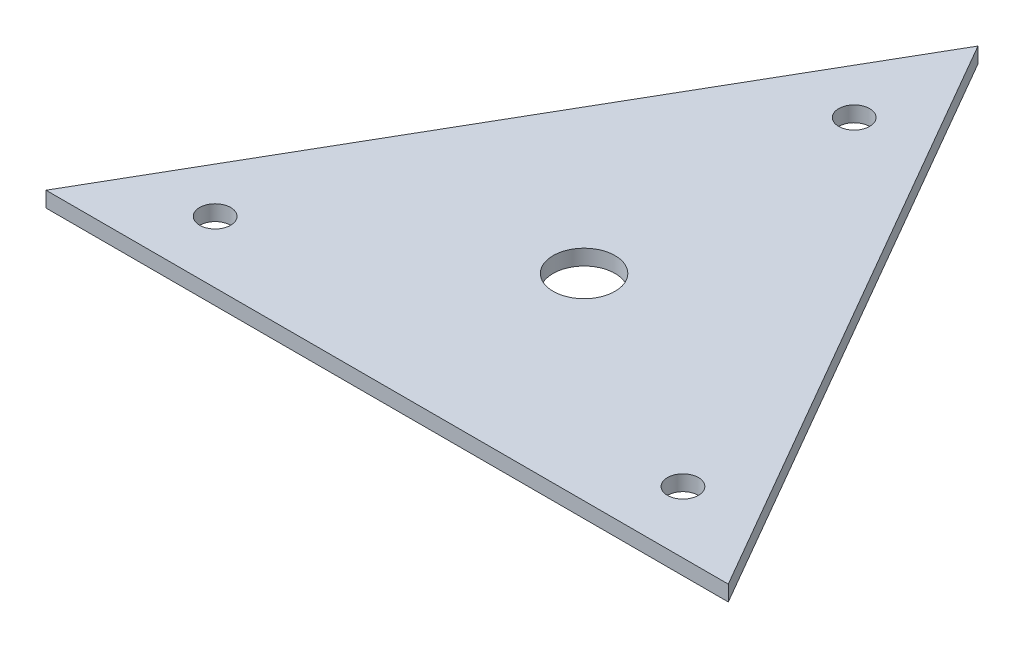
ISO-10303-21;
HEADER;
FILE_DESCRIPTION(('STEP AP214'),'2;1');
FILE_NAME('part.step','',(''),(''),'','','');
FILE_SCHEMA(('AUTOMOTIVE_DESIGN { 1 0 10303 214 1 1 1 1 }'));
ENDSEC;
DATA;
#1=APPLICATION_CONTEXT('core data for automotive mechanical design processes');
#2=APPLICATION_PROTOCOL_DEFINITION('international standard','automotive_design',2000,#1);
#3=PRODUCT_CONTEXT('',#1,'mechanical');
#4=PRODUCT('Part','Part','',(#3));
#5=PRODUCT_RELATED_PRODUCT_CATEGORY('part','',(#4));
#6=PRODUCT_DEFINITION_FORMATION('','',#4);
#7=PRODUCT_DEFINITION_CONTEXT('part definition',#1,'design');
#8=PRODUCT_DEFINITION('design','',#6,#7);
#9=PRODUCT_DEFINITION_SHAPE('','',#8);
#10=(LENGTH_UNIT() NAMED_UNIT(*) SI_UNIT(.MILLI.,.METRE.));
#11=(NAMED_UNIT(*) PLANE_ANGLE_UNIT() SI_UNIT($,.RADIAN.));
#12=(NAMED_UNIT(*) SI_UNIT($,.STERADIAN.) SOLID_ANGLE_UNIT());
#13=UNCERTAINTY_MEASURE_WITH_UNIT(LENGTH_MEASURE(1.E-05),#10,'distance_accuracy_value','');
#14=(GEOMETRIC_REPRESENTATION_CONTEXT(3) GLOBAL_UNCERTAINTY_ASSIGNED_CONTEXT((#13)) GLOBAL_UNIT_ASSIGNED_CONTEXT((#10,
#11,#12)) REPRESENTATION_CONTEXT('',''));
#15=CARTESIAN_POINT('',(0.,0.,0.));
#16=DIRECTION('',(0.,0.,1.));
#17=DIRECTION('',(1.,0.,0.));
#18=AXIS2_PLACEMENT_3D('',#15,#16,#17);
#19=CARTESIAN_POINT('',(0.,3.175,0.));
#20=DIRECTION('',(0.,1.,0.));
#21=DIRECTION('',(0.,0.,1.));
#22=AXIS2_PLACEMENT_3D('',#19,#20,#21);
#23=PLANE('',#22);
#24=CARTESIAN_POINT('',(21.9970452561248,3.175,-12.6999999999999));
#25=DIRECTION('',(0.,1.,0.));
#26=DIRECTION('',(0.,0.,1.));
#27=AXIS2_PLACEMENT_3D('',#24,#25,#26);
#28=CIRCLE('',#27,3.17499999999999);
#29=CARTESIAN_POINT('',(21.9970452561248,3.175,-9.52499999999988));
#30=VERTEX_POINT('',#29);
#31=EDGE_CURVE('E135',#30,#30,#28,.T.);
#32=ORIENTED_EDGE('',*,*,#31,.F.);
#33=EDGE_LOOP('',(#32));
#34=FACE_BOUND('',#33,.T.);
#35=CARTESIAN_POINT('',(69.9770000000005,3.175,-40.4012397870822));
#36=DIRECTION('',(0.,1.,0.));
#37=DIRECTION('',(0.,0.,1.));
#38=AXIS2_PLACEMENT_3D('',#35,#36,#37);
#39=CIRCLE('',#38,6.35000000000001);
#40=CARTESIAN_POINT('',(69.9770000000005,3.175,-34.0512397870822));
#41=VERTEX_POINT('',#40);
#42=EDGE_CURVE('E94',#41,#41,#39,.T.);
#43=ORIENTED_EDGE('',*,*,#42,.F.);
#44=EDGE_LOOP('',(#43));
#45=FACE_BOUND('',#44,.T.);
#46=DIRECTION('',(-0.500000000000004,0.,0.866025403784436));
#47=VECTOR('',#46,1.);
#48=CARTESIAN_POINT('',(69.9770000000006,3.175,-121.203719361247));
#49=LINE('',#48,#47);
#50=CARTESIAN_POINT('',(69.9770000000006,3.175,-121.203719361247));
#51=VERTEX_POINT('',#50);
#52=CARTESIAN_POINT('',(0.,3.175,0.));
#53=VERTEX_POINT('',#52);
#54=EDGE_CURVE('E82',#51,#53,#49,.T.);
#55=ORIENTED_EDGE('',*,*,#54,.T.);
#56=DIRECTION('',(1.,0.,0.));
#57=VECTOR('',#56,1.);
#58=CARTESIAN_POINT('',(0.,3.175,0.));
#59=LINE('',#58,#57);
#60=CARTESIAN_POINT('',(139.954,3.175,0.));
#61=VERTEX_POINT('',#60);
#62=EDGE_CURVE('E77',#53,#61,#59,.T.);
#63=ORIENTED_EDGE('',*,*,#62,.T.);
#64=DIRECTION('',(-0.499999999999998,0.,-0.86602540378444));
#65=VECTOR('',#64,1.);
#66=CARTESIAN_POINT('',(69.9770000000006,3.175,-121.203719361247));
#67=LINE('',#66,#65);
#68=EDGE_CURVE('E57',#61,#51,#67,.T.);
#69=ORIENTED_EDGE('',*,*,#68,.T.);
#70=EDGE_LOOP('',(#55,#63,#69));
#71=FACE_BOUND('',#70,.T.);
#72=CARTESIAN_POINT('',(117.956954743875,3.175,-12.7));
#73=DIRECTION('',(0.,1.,0.));
#74=DIRECTION('',(0.,0.,1.));
#75=AXIS2_PLACEMENT_3D('',#72,#73,#74);
#76=CIRCLE('',#75,3.175);
#77=CARTESIAN_POINT('',(117.956954743875,3.175,-9.52500000000003));
#78=VERTEX_POINT('',#77);
#79=EDGE_CURVE('E141',#78,#78,#76,.T.);
#80=ORIENTED_EDGE('',*,*,#79,.F.);
#81=EDGE_LOOP('',(#80));
#82=FACE_BOUND('',#81,.T.);
#83=CARTESIAN_POINT('',(69.9770000000006,3.175,-95.803719361247));
#84=DIRECTION('',(0.,1.,0.));
#85=DIRECTION('',(0.,0.,1.));
#86=AXIS2_PLACEMENT_3D('',#83,#84,#85);
#87=CIRCLE('',#86,3.17499999999996);
#88=CARTESIAN_POINT('',(69.9770000000006,3.175,-92.6287193612471));
#89=VERTEX_POINT('',#88);
#90=EDGE_CURVE('E129',#89,#89,#87,.T.);
#91=ORIENTED_EDGE('',*,*,#90,.F.);
#92=EDGE_LOOP('',(#91));
#93=FACE_BOUND('',#92,.T.);
#94=ADVANCED_FACE('F39',(#34,#45,#71,#82,#93),#23,.T.);
#95=CARTESIAN_POINT('',(0.,0.,0.));
#96=DIRECTION('',(0.,1.,0.));
#97=DIRECTION('',(0.,0.,1.));
#98=AXIS2_PLACEMENT_3D('',#95,#96,#97);
#99=PLANE('',#98);
#100=DIRECTION('',(-0.500000000000004,0.,0.866025403784436));
#101=VECTOR('',#100,1.);
#102=CARTESIAN_POINT('',(69.9770000000006,0.,-121.203719361247));
#103=LINE('',#102,#101);
#104=CARTESIAN_POINT('',(69.9770000000006,0.,-121.203719361247));
#105=VERTEX_POINT('',#104);
#106=CARTESIAN_POINT('',(0.,0.,0.));
#107=VERTEX_POINT('',#106);
#108=EDGE_CURVE('E90',#105,#107,#103,.T.);
#109=ORIENTED_EDGE('',*,*,#108,.F.);
#110=DIRECTION('',(-0.499999999999998,0.,-0.86602540378444));
#111=VECTOR('',#110,1.);
#112=CARTESIAN_POINT('',(69.9770000000006,0.,-121.203719361247));
#113=LINE('',#112,#111);
#114=CARTESIAN_POINT('',(139.954,0.,0.));
#115=VERTEX_POINT('',#114);
#116=EDGE_CURVE('E74',#115,#105,#113,.T.);
#117=ORIENTED_EDGE('',*,*,#116,.F.);
#118=DIRECTION('',(1.,0.,0.));
#119=VECTOR('',#118,1.);
#120=CARTESIAN_POINT('',(0.,0.,0.));
#121=LINE('',#120,#119);
#122=EDGE_CURVE('E69',#107,#115,#121,.T.);
#123=ORIENTED_EDGE('',*,*,#122,.F.);
#124=EDGE_LOOP('',(#109,#117,#123));
#125=FACE_BOUND('',#124,.T.);
#126=CARTESIAN_POINT('',(69.9770000000005,0.,-40.4012397870822));
#127=DIRECTION('',(0.,1.,0.));
#128=DIRECTION('',(0.,0.,1.));
#129=AXIS2_PLACEMENT_3D('',#126,#127,#128);
#130=CIRCLE('',#129,6.35000000000001);
#131=CARTESIAN_POINT('',(69.9770000000005,0.,-34.0512397870822));
#132=VERTEX_POINT('',#131);
#133=EDGE_CURVE('E100',#132,#132,#130,.T.);
#134=ORIENTED_EDGE('',*,*,#133,.T.);
#135=EDGE_LOOP('',(#134));
#136=FACE_BOUND('',#135,.T.);
#137=CARTESIAN_POINT('',(117.956954743875,0.,-12.7));
#138=DIRECTION('',(0.,1.,0.));
#139=DIRECTION('',(0.,0.,1.));
#140=AXIS2_PLACEMENT_3D('',#137,#138,#139);
#141=CIRCLE('',#140,3.175);
#142=CARTESIAN_POINT('',(117.956954743875,0.,-9.52500000000003));
#143=VERTEX_POINT('',#142);
#144=EDGE_CURVE('E119',#143,#143,#141,.T.);
#145=ORIENTED_EDGE('',*,*,#144,.T.);
#146=EDGE_LOOP('',(#145));
#147=FACE_BOUND('',#146,.T.);
#148=CARTESIAN_POINT('',(21.9970452561248,0.,-12.6999999999999));
#149=DIRECTION('',(0.,1.,0.));
#150=DIRECTION('',(0.,0.,1.));
#151=AXIS2_PLACEMENT_3D('',#148,#149,#150);
#152=CIRCLE('',#151,3.17499999999999);
#153=CARTESIAN_POINT('',(21.9970452561248,0.,-9.52499999999988));
#154=VERTEX_POINT('',#153);
#155=EDGE_CURVE('E123',#154,#154,#152,.T.);
#156=ORIENTED_EDGE('',*,*,#155,.T.);
#157=EDGE_LOOP('',(#156));
#158=FACE_BOUND('',#157,.T.);
#159=CARTESIAN_POINT('',(69.9770000000006,0.,-95.803719361247));
#160=DIRECTION('',(0.,1.,0.));
#161=DIRECTION('',(0.,0.,1.));
#162=AXIS2_PLACEMENT_3D('',#159,#160,#161);
#163=CIRCLE('',#162,3.17499999999996);
#164=CARTESIAN_POINT('',(69.9770000000006,0.,-92.6287193612471));
#165=VERTEX_POINT('',#164);
#166=EDGE_CURVE('E126',#165,#165,#163,.T.);
#167=ORIENTED_EDGE('',*,*,#166,.T.);
#168=EDGE_LOOP('',(#167));
#169=FACE_BOUND('',#168,.T.);
#170=ADVANCED_FACE('F109',(#125,#136,#147,#158,#169),#99,.F.);
#171=CARTESIAN_POINT('',(69.9770000000006,3.175,-121.203719361247));
#172=DIRECTION('',(0.866025403784436,0.,0.500000000000004));
#173=DIRECTION('',(0.500000000000004,0.,-0.866025403784436));
#174=AXIS2_PLACEMENT_3D('',#171,#172,#173);
#175=PLANE('',#174);
#176=ORIENTED_EDGE('',*,*,#108,.T.);
#177=DIRECTION('',(0.,-1.,0.));
#178=VECTOR('',#177,1.);
#179=CARTESIAN_POINT('',(0.,3.175,0.));
#180=LINE('',#179,#178);
#181=EDGE_CURVE('E11',#53,#107,#180,.T.);
#182=ORIENTED_EDGE('',*,*,#181,.F.);
#183=ORIENTED_EDGE('',*,*,#54,.F.);
#184=DIRECTION('',(0.,-1.,0.));
#185=VECTOR('',#184,1.);
#186=CARTESIAN_POINT('',(69.9770000000006,3.175,-121.203719361247));
#187=LINE('',#186,#185);
#188=EDGE_CURVE('E91',#51,#105,#187,.T.);
#189=ORIENTED_EDGE('',*,*,#188,.T.);
#190=EDGE_LOOP('',(#176,#182,#183,#189));
#191=FACE_BOUND('',#190,.T.);
#192=ADVANCED_FACE('F41',(#191),#175,.F.);
#193=CARTESIAN_POINT('',(0.,3.175,0.));
#194=DIRECTION('',(0.,0.,-1.));
#195=DIRECTION('',(-1.,0.,0.));
#196=AXIS2_PLACEMENT_3D('',#193,#194,#195);
#197=PLANE('',#196);
#198=ORIENTED_EDGE('',*,*,#122,.T.);
#199=DIRECTION('',(0.,-1.,0.));
#200=VECTOR('',#199,1.);
#201=CARTESIAN_POINT('',(139.954,3.175,0.));
#202=LINE('',#201,#200);
#203=EDGE_CURVE('E49',#61,#115,#202,.T.);
#204=ORIENTED_EDGE('',*,*,#203,.F.);
#205=ORIENTED_EDGE('',*,*,#62,.F.);
#206=ORIENTED_EDGE('',*,*,#181,.T.);
#207=EDGE_LOOP('',(#198,#204,#205,#206));
#208=FACE_BOUND('',#207,.T.);
#209=ADVANCED_FACE('F78',(#208),#197,.F.);
#210=CARTESIAN_POINT('',(69.9770000000006,3.175,-121.203719361247));
#211=DIRECTION('',(-0.86602540378444,0.,0.499999999999998));
#212=DIRECTION('',(0.499999999999998,0.,0.86602540378444));
#213=AXIS2_PLACEMENT_3D('',#210,#211,#212);
#214=PLANE('',#213);
#215=ORIENTED_EDGE('',*,*,#116,.T.);
#216=ORIENTED_EDGE('',*,*,#188,.F.);
#217=ORIENTED_EDGE('',*,*,#68,.F.);
#218=ORIENTED_EDGE('',*,*,#203,.T.);
#219=EDGE_LOOP('',(#215,#216,#217,#218));
#220=FACE_BOUND('',#219,.T.);
#221=ADVANCED_FACE('F108',(#220),#214,.F.);
#222=CARTESIAN_POINT('',(69.9770000000005,3.175,-40.4012397870822));
#223=DIRECTION('',(0.,-1.,0.));
#224=DIRECTION('',(0.,0.,-1.));
#225=AXIS2_PLACEMENT_3D('',#222,#223,#224);
#226=CYLINDRICAL_SURFACE('',#225,6.35000000000001);
#227=ORIENTED_EDGE('',*,*,#42,.T.);
#228=EDGE_LOOP('',(#227));
#229=FACE_BOUND('',#228,.T.);
#230=ORIENTED_EDGE('',*,*,#133,.F.);
#231=EDGE_LOOP('',(#230));
#232=FACE_BOUND('',#231,.T.);
#233=ADVANCED_FACE('F170',(#229,#232),#226,.F.);
#234=CARTESIAN_POINT('',(117.956954743875,3.175,-12.7));
#235=DIRECTION('',(0.,-1.,0.));
#236=DIRECTION('',(0.,0.,-1.));
#237=AXIS2_PLACEMENT_3D('',#234,#235,#236);
#238=CYLINDRICAL_SURFACE('',#237,3.175);
#239=ORIENTED_EDGE('',*,*,#79,.T.);
#240=EDGE_LOOP('',(#239));
#241=FACE_BOUND('',#240,.T.);
#242=ORIENTED_EDGE('',*,*,#144,.F.);
#243=EDGE_LOOP('',(#242));
#244=FACE_BOUND('',#243,.T.);
#245=ADVANCED_FACE('F150',(#241,#244),#238,.F.);
#246=CARTESIAN_POINT('',(21.9970452561248,3.175,-12.6999999999999));
#247=DIRECTION('',(0.,-1.,0.));
#248=DIRECTION('',(0.,0.,-1.));
#249=AXIS2_PLACEMENT_3D('',#246,#247,#248);
#250=CYLINDRICAL_SURFACE('',#249,3.17499999999999);
#251=ORIENTED_EDGE('',*,*,#31,.T.);
#252=EDGE_LOOP('',(#251));
#253=FACE_BOUND('',#252,.T.);
#254=ORIENTED_EDGE('',*,*,#155,.F.);
#255=EDGE_LOOP('',(#254));
#256=FACE_BOUND('',#255,.T.);
#257=ADVANCED_FACE('F160',(#253,#256),#250,.F.);
#258=CARTESIAN_POINT('',(69.9770000000006,3.175,-95.803719361247));
#259=DIRECTION('',(0.,-1.,0.));
#260=DIRECTION('',(0.,0.,-1.));
#261=AXIS2_PLACEMENT_3D('',#258,#259,#260);
#262=CYLINDRICAL_SURFACE('',#261,3.17499999999996);
#263=ORIENTED_EDGE('',*,*,#90,.T.);
#264=EDGE_LOOP('',(#263));
#265=FACE_BOUND('',#264,.T.);
#266=ORIENTED_EDGE('',*,*,#166,.F.);
#267=EDGE_LOOP('',(#266));
#268=FACE_BOUND('',#267,.T.);
#269=ADVANCED_FACE('F158',(#265,#268),#262,.F.);
#270=CLOSED_SHELL('',(#94,#170,#192,#209,#221,#233,#245,#257,#269));
#271=MANIFOLD_SOLID_BREP('B2',#270);
#272=ADVANCED_BREP_SHAPE_REPRESENTATION('',(#18,#271),#14);
#273=SHAPE_DEFINITION_REPRESENTATION(#9,#272);
ENDSEC;
END-ISO-10303-21;
